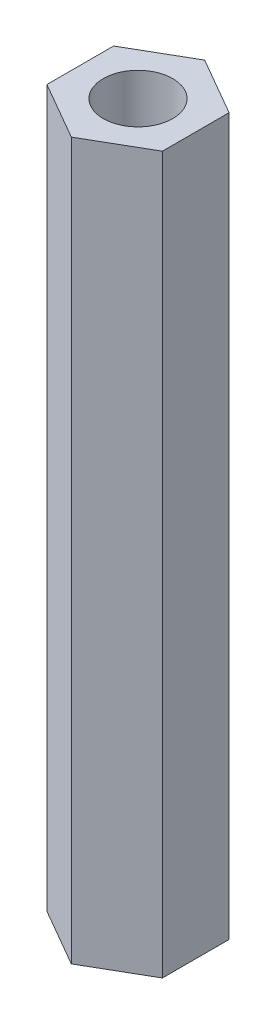
ISO-10303-21;
HEADER;
FILE_DESCRIPTION(('STEP AP214'),'2;1');
FILE_NAME('part.step','',(''),(''),'','','');
FILE_SCHEMA(('AUTOMOTIVE_DESIGN { 1 0 10303 214 1 1 1 1 }'));
ENDSEC;
DATA;
#1=APPLICATION_CONTEXT('core data for automotive mechanical design processes');
#2=APPLICATION_PROTOCOL_DEFINITION('international standard','automotive_design',2000,#1);
#3=PRODUCT_CONTEXT('',#1,'mechanical');
#4=PRODUCT('Part','Part','',(#3));
#5=PRODUCT_RELATED_PRODUCT_CATEGORY('part','',(#4));
#6=PRODUCT_DEFINITION_FORMATION('','',#4);
#7=PRODUCT_DEFINITION_CONTEXT('part definition',#1,'design');
#8=PRODUCT_DEFINITION('design','',#6,#7);
#9=PRODUCT_DEFINITION_SHAPE('','',#8);
#10=(LENGTH_UNIT() NAMED_UNIT(*) SI_UNIT(.MILLI.,.METRE.));
#11=(NAMED_UNIT(*) PLANE_ANGLE_UNIT() SI_UNIT($,.RADIAN.));
#12=(NAMED_UNIT(*) SI_UNIT($,.STERADIAN.) SOLID_ANGLE_UNIT());
#13=UNCERTAINTY_MEASURE_WITH_UNIT(LENGTH_MEASURE(1.E-05),#10,'distance_accuracy_value','');
#14=(GEOMETRIC_REPRESENTATION_CONTEXT(3) GLOBAL_UNCERTAINTY_ASSIGNED_CONTEXT((#13)) GLOBAL_UNIT_ASSIGNED_CONTEXT((#10,
#11,#12)) REPRESENTATION_CONTEXT('',''));
#15=CARTESIAN_POINT('',(0.,0.,0.));
#16=DIRECTION('',(0.,0.,1.));
#17=DIRECTION('',(1.,0.,0.));
#18=AXIS2_PLACEMENT_3D('',#15,#16,#17);
#19=CARTESIAN_POINT('',(2.5,31.,1.44337567297406));
#20=DIRECTION('',(-1.,0.,0.));
#21=DIRECTION('',(0.,0.,1.));
#22=AXIS2_PLACEMENT_3D('',#19,#20,#21);
#23=PLANE('',#22);
#24=DIRECTION('',(0.,0.,-1.));
#25=VECTOR('',#24,1.);
#26=CARTESIAN_POINT('',(2.5,0.,1.44337567297406));
#27=LINE('',#26,#25);
#28=CARTESIAN_POINT('',(2.5,0.,1.44337567297406));
#29=VERTEX_POINT('',#28);
#30=CARTESIAN_POINT('',(2.5,0.,-1.44337567297406));
#31=VERTEX_POINT('',#30);
#32=EDGE_CURVE('E118',#29,#31,#27,.T.);
#33=ORIENTED_EDGE('',*,*,#32,.T.);
#34=DIRECTION('',(0.,-1.,0.));
#35=VECTOR('',#34,1.);
#36=CARTESIAN_POINT('',(2.5,31.,-1.44337567297406));
#37=LINE('',#36,#35);
#38=CARTESIAN_POINT('',(2.5,31.,-1.44337567297406));
#39=VERTEX_POINT('',#38);
#40=EDGE_CURVE('E11',#39,#31,#37,.T.);
#41=ORIENTED_EDGE('',*,*,#40,.F.);
#42=DIRECTION('',(0.,0.,-1.));
#43=VECTOR('',#42,1.);
#44=CARTESIAN_POINT('',(2.5,31.,1.44337567297406));
#45=LINE('',#44,#43);
#46=CARTESIAN_POINT('',(2.5,31.,1.44337567297406));
#47=VERTEX_POINT('',#46);
#48=EDGE_CURVE('E129',#47,#39,#45,.T.);
#49=ORIENTED_EDGE('',*,*,#48,.F.);
#50=DIRECTION('',(0.,-1.,0.));
#51=VECTOR('',#50,1.);
#52=CARTESIAN_POINT('',(2.5,31.,1.44337567297406));
#53=LINE('',#52,#51);
#54=EDGE_CURVE('E114',#47,#29,#53,.T.);
#55=ORIENTED_EDGE('',*,*,#54,.T.);
#56=EDGE_LOOP('',(#33,#41,#49,#55));
#57=FACE_BOUND('',#56,.T.);
#58=ADVANCED_FACE('F34',(#57),#23,.F.);
#59=CARTESIAN_POINT('',(2.5,31.,-1.44337567297406));
#60=DIRECTION('',(-0.5,0.,0.866025403784439));
#61=DIRECTION('',(0.866025403784439,0.,0.5));
#62=AXIS2_PLACEMENT_3D('',#59,#60,#61);
#63=PLANE('',#62);
#64=DIRECTION('',(-0.866025403784439,0.,-0.5));
#65=VECTOR('',#64,1.);
#66=CARTESIAN_POINT('',(2.5,0.,-1.44337567297406));
#67=LINE('',#66,#65);
#68=CARTESIAN_POINT('',(0.,0.,-2.88675134594813));
#69=VERTEX_POINT('',#68);
#70=EDGE_CURVE('E121',#31,#69,#67,.T.);
#71=ORIENTED_EDGE('',*,*,#70,.T.);
#72=DIRECTION('',(0.,-1.,0.));
#73=VECTOR('',#72,1.);
#74=CARTESIAN_POINT('',(0.,31.,-2.88675134594813));
#75=LINE('',#74,#73);
#76=CARTESIAN_POINT('',(0.,31.,-2.88675134594813));
#77=VERTEX_POINT('',#76);
#78=EDGE_CURVE('E42',#77,#69,#75,.T.);
#79=ORIENTED_EDGE('',*,*,#78,.F.);
#80=DIRECTION('',(-0.866025403784439,0.,-0.5));
#81=VECTOR('',#80,1.);
#82=CARTESIAN_POINT('',(2.5,31.,-1.44337567297406));
#83=LINE('',#82,#81);
#84=EDGE_CURVE('E87',#39,#77,#83,.T.);
#85=ORIENTED_EDGE('',*,*,#84,.F.);
#86=ORIENTED_EDGE('',*,*,#40,.T.);
#87=EDGE_LOOP('',(#71,#79,#85,#86));
#88=FACE_BOUND('',#87,.T.);
#89=ADVANCED_FACE('F154',(#88),#63,.F.);
#90=CARTESIAN_POINT('',(0.,31.,-2.88675134594813));
#91=DIRECTION('',(0.5,0.,0.866025403784439));
#92=DIRECTION('',(0.866025403784439,0.,-0.5));
#93=AXIS2_PLACEMENT_3D('',#90,#91,#92);
#94=PLANE('',#93);
#95=DIRECTION('',(-0.866025403784438,0.,0.5));
#96=VECTOR('',#95,1.);
#97=CARTESIAN_POINT('',(0.,0.,-2.88675134594813));
#98=LINE('',#97,#96);
#99=CARTESIAN_POINT('',(-2.5,0.,-1.44337567297406));
#100=VERTEX_POINT('',#99);
#101=EDGE_CURVE('E124',#69,#100,#98,.T.);
#102=ORIENTED_EDGE('',*,*,#101,.T.);
#103=DIRECTION('',(0.,-1.,0.));
#104=VECTOR('',#103,1.);
#105=CARTESIAN_POINT('',(-2.5,31.,-1.44337567297406));
#106=LINE('',#105,#104);
#107=CARTESIAN_POINT('',(-2.5,31.,-1.44337567297406));
#108=VERTEX_POINT('',#107);
#109=EDGE_CURVE('E109',#108,#100,#106,.T.);
#110=ORIENTED_EDGE('',*,*,#109,.F.);
#111=DIRECTION('',(-0.866025403784438,0.,0.5));
#112=VECTOR('',#111,1.);
#113=CARTESIAN_POINT('',(0.,31.,-2.88675134594813));
#114=LINE('',#113,#112);
#115=EDGE_CURVE('E100',#77,#108,#114,.T.);
#116=ORIENTED_EDGE('',*,*,#115,.F.);
#117=ORIENTED_EDGE('',*,*,#78,.T.);
#118=EDGE_LOOP('',(#102,#110,#116,#117));
#119=FACE_BOUND('',#118,.T.);
#120=ADVANCED_FACE('F135',(#119),#94,.F.);
#121=CARTESIAN_POINT('',(-2.5,31.,-1.44337567297406));
#122=DIRECTION('',(1.,0.,0.));
#123=DIRECTION('',(0.,0.,-1.));
#124=AXIS2_PLACEMENT_3D('',#121,#122,#123);
#125=PLANE('',#124);
#126=DIRECTION('',(0.,0.,1.));
#127=VECTOR('',#126,1.);
#128=CARTESIAN_POINT('',(-2.5,0.,-1.44337567297406));
#129=LINE('',#128,#127);
#130=CARTESIAN_POINT('',(-2.5,0.,1.44337567297406));
#131=VERTEX_POINT('',#130);
#132=EDGE_CURVE('E108',#100,#131,#129,.T.);
#133=ORIENTED_EDGE('',*,*,#132,.T.);
#134=DIRECTION('',(0.,-1.,0.));
#135=VECTOR('',#134,1.);
#136=CARTESIAN_POINT('',(-2.5,31.,1.44337567297406));
#137=LINE('',#136,#135);
#138=CARTESIAN_POINT('',(-2.5,31.,1.44337567297406));
#139=VERTEX_POINT('',#138);
#140=EDGE_CURVE('E105',#139,#131,#137,.T.);
#141=ORIENTED_EDGE('',*,*,#140,.F.);
#142=DIRECTION('',(0.,0.,1.));
#143=VECTOR('',#142,1.);
#144=CARTESIAN_POINT('',(-2.5,31.,-1.44337567297406));
#145=LINE('',#144,#143);
#146=EDGE_CURVE('E94',#108,#139,#145,.T.);
#147=ORIENTED_EDGE('',*,*,#146,.F.);
#148=ORIENTED_EDGE('',*,*,#109,.T.);
#149=EDGE_LOOP('',(#133,#141,#147,#148));
#150=FACE_BOUND('',#149,.T.);
#151=ADVANCED_FACE('F106',(#150),#125,.F.);
#152=CARTESIAN_POINT('',(-2.5,31.,1.44337567297406));
#153=DIRECTION('',(0.5,0.,-0.866025403784439));
#154=DIRECTION('',(-0.866025403784439,0.,-0.5));
#155=AXIS2_PLACEMENT_3D('',#152,#153,#154);
#156=PLANE('',#155);
#157=DIRECTION('',(0.866025403784439,0.,0.5));
#158=VECTOR('',#157,1.);
#159=CARTESIAN_POINT('',(-2.5,0.,1.44337567297406));
#160=LINE('',#159,#158);
#161=CARTESIAN_POINT('',(0.,0.,2.88675134594813));
#162=VERTEX_POINT('',#161);
#163=EDGE_CURVE('E73',#131,#162,#160,.T.);
#164=ORIENTED_EDGE('',*,*,#163,.T.);
#165=DIRECTION('',(0.,-1.,0.));
#166=VECTOR('',#165,1.);
#167=CARTESIAN_POINT('',(0.,31.,2.88675134594813));
#168=LINE('',#167,#166);
#169=CARTESIAN_POINT('',(0.,31.,2.88675134594813));
#170=VERTEX_POINT('',#169);
#171=EDGE_CURVE('E110',#170,#162,#168,.T.);
#172=ORIENTED_EDGE('',*,*,#171,.F.);
#173=DIRECTION('',(0.866025403784439,0.,0.5));
#174=VECTOR('',#173,1.);
#175=CARTESIAN_POINT('',(-2.5,31.,1.44337567297406));
#176=LINE('',#175,#174);
#177=EDGE_CURVE('E98',#139,#170,#176,.T.);
#178=ORIENTED_EDGE('',*,*,#177,.F.);
#179=ORIENTED_EDGE('',*,*,#140,.T.);
#180=EDGE_LOOP('',(#164,#172,#178,#179));
#181=FACE_BOUND('',#180,.T.);
#182=ADVANCED_FACE('F112',(#181),#156,.F.);
#183=CARTESIAN_POINT('',(0.,31.,2.88675134594813));
#184=DIRECTION('',(-0.5,0.,-0.866025403784439));
#185=DIRECTION('',(-0.866025403784439,0.,0.5));
#186=AXIS2_PLACEMENT_3D('',#183,#184,#185);
#187=PLANE('',#186);
#188=DIRECTION('',(0.866025403784439,0.,-0.5));
#189=VECTOR('',#188,1.);
#190=CARTESIAN_POINT('',(0.,0.,2.88675134594813));
#191=LINE('',#190,#189);
#192=EDGE_CURVE('E79',#162,#29,#191,.T.);
#193=ORIENTED_EDGE('',*,*,#192,.T.);
#194=ORIENTED_EDGE('',*,*,#54,.F.);
#195=DIRECTION('',(0.866025403784439,0.,-0.5));
#196=VECTOR('',#195,1.);
#197=CARTESIAN_POINT('',(0.,31.,2.88675134594813));
#198=LINE('',#197,#196);
#199=EDGE_CURVE('E50',#170,#47,#198,.T.);
#200=ORIENTED_EDGE('',*,*,#199,.F.);
#201=ORIENTED_EDGE('',*,*,#171,.T.);
#202=EDGE_LOOP('',(#193,#194,#200,#201));
#203=FACE_BOUND('',#202,.T.);
#204=ADVANCED_FACE('F142',(#203),#187,.F.);
#205=CARTESIAN_POINT('',(0.,31.,0.));
#206=DIRECTION('',(0.,1.,0.));
#207=DIRECTION('',(0.,0.,1.));
#208=AXIS2_PLACEMENT_3D('',#205,#206,#207);
#209=PLANE('',#208);
#210=CARTESIAN_POINT('',(0.,31.,0.));
#211=DIRECTION('',(0.,1.,0.));
#212=DIRECTION('',(0.,0.,1.));
#213=AXIS2_PLACEMENT_3D('',#210,#211,#212);
#214=CIRCLE('',#213,1.5025);
#215=CARTESIAN_POINT('',(0.,31.,1.5025));
#216=VERTEX_POINT('',#215);
#217=EDGE_CURVE('E238',#216,#216,#214,.T.);
#218=ORIENTED_EDGE('',*,*,#217,.F.);
#219=EDGE_LOOP('',(#218));
#220=FACE_BOUND('',#219,.T.);
#221=ORIENTED_EDGE('',*,*,#48,.T.);
#222=ORIENTED_EDGE('',*,*,#84,.T.);
#223=ORIENTED_EDGE('',*,*,#115,.T.);
#224=ORIENTED_EDGE('',*,*,#146,.T.);
#225=ORIENTED_EDGE('',*,*,#177,.T.);
#226=ORIENTED_EDGE('',*,*,#199,.T.);
#227=EDGE_LOOP('',(#221,#222,#223,#224,#225,#226));
#228=FACE_BOUND('',#227,.T.);
#229=ADVANCED_FACE('F96',(#220,#228),#209,.T.);
#230=CARTESIAN_POINT('',(0.,0.,0.));
#231=DIRECTION('',(0.,1.,0.));
#232=DIRECTION('',(0.,0.,1.));
#233=AXIS2_PLACEMENT_3D('',#230,#231,#232);
#234=PLANE('',#233);
#235=CARTESIAN_POINT('',(0.,0.,0.));
#236=DIRECTION('',(0.,1.,0.));
#237=DIRECTION('',(0.,0.,1.));
#238=AXIS2_PLACEMENT_3D('',#235,#236,#237);
#239=CIRCLE('',#238,1.5025);
#240=CARTESIAN_POINT('',(0.,0.,1.5025));
#241=VERTEX_POINT('',#240);
#242=EDGE_CURVE('E237',#241,#241,#239,.T.);
#243=ORIENTED_EDGE('',*,*,#242,.T.);
#244=EDGE_LOOP('',(#243));
#245=FACE_BOUND('',#244,.T.);
#246=ORIENTED_EDGE('',*,*,#32,.F.);
#247=ORIENTED_EDGE('',*,*,#192,.F.);
#248=ORIENTED_EDGE('',*,*,#163,.F.);
#249=ORIENTED_EDGE('',*,*,#132,.F.);
#250=ORIENTED_EDGE('',*,*,#101,.F.);
#251=ORIENTED_EDGE('',*,*,#70,.F.);
#252=EDGE_LOOP('',(#246,#247,#248,#249,#250,#251));
#253=FACE_BOUND('',#252,.T.);
#254=ADVANCED_FACE('F138',(#245,#253),#234,.F.);
#255=CARTESIAN_POINT('',(0.,6.005,0.));
#256=DIRECTION('',(0.,-1.,0.));
#257=DIRECTION('',(0.,0.,-1.));
#258=AXIS2_PLACEMENT_3D('',#255,#256,#257);
#259=CYLINDRICAL_SURFACE('',#258,1.5025);
#260=CARTESIAN_POINT('',(0.,6.005,0.));
#261=DIRECTION('',(0.,1.,0.));
#262=DIRECTION('',(0.,0.,1.));
#263=AXIS2_PLACEMENT_3D('',#260,#261,#262);
#264=CIRCLE('',#263,1.5025);
#265=CARTESIAN_POINT('',(0.,6.005,1.5025));
#266=VERTEX_POINT('',#265);
#267=EDGE_CURVE('E122',#266,#266,#264,.T.);
#268=ORIENTED_EDGE('',*,*,#267,.T.);
#269=EDGE_LOOP('',(#268));
#270=FACE_BOUND('',#269,.T.);
#271=ORIENTED_EDGE('',*,*,#242,.F.);
#272=EDGE_LOOP('',(#271));
#273=FACE_BOUND('',#272,.T.);
#274=ADVANCED_FACE('F186',(#270,#273),#259,.F.);
#275=CARTESIAN_POINT('',(0.,6.005,0.));
#276=DIRECTION('',(0.,1.,0.));
#277=DIRECTION('',(0.,0.,1.));
#278=AXIS2_PLACEMENT_3D('',#275,#276,#277);
#279=PLANE('',#278);
#280=ORIENTED_EDGE('',*,*,#267,.F.);
#281=EDGE_LOOP('',(#280));
#282=FACE_BOUND('',#281,.T.);
#283=ADVANCED_FACE('F195',(#282),#279,.F.);
#284=CARTESIAN_POINT('',(0.,27.995,0.));
#285=DIRECTION('',(0.,1.,0.));
#286=DIRECTION('',(0.,0.,1.));
#287=AXIS2_PLACEMENT_3D('',#284,#285,#286);
#288=CYLINDRICAL_SURFACE('',#287,1.5025);
#289=CARTESIAN_POINT('',(0.,27.995,0.));
#290=DIRECTION('',(0.,1.,0.));
#291=DIRECTION('',(0.,0.,1.));
#292=AXIS2_PLACEMENT_3D('',#289,#290,#291);
#293=CIRCLE('',#292,1.5025);
#294=CARTESIAN_POINT('',(0.,27.995,1.5025));
#295=VERTEX_POINT('',#294);
#296=EDGE_CURVE('E236',#295,#295,#293,.T.);
#297=ORIENTED_EDGE('',*,*,#296,.F.);
#298=EDGE_LOOP('',(#297));
#299=FACE_BOUND('',#298,.T.);
#300=ORIENTED_EDGE('',*,*,#217,.T.);
#301=EDGE_LOOP('',(#300));
#302=FACE_BOUND('',#301,.T.);
#303=ADVANCED_FACE('F205',(#299,#302),#288,.F.);
#304=CARTESIAN_POINT('',(0.,27.995,0.));
#305=DIRECTION('',(0.,1.,0.));
#306=DIRECTION('',(0.,0.,1.));
#307=AXIS2_PLACEMENT_3D('',#304,#305,#306);
#308=PLANE('',#307);
#309=ORIENTED_EDGE('',*,*,#296,.T.);
#310=EDGE_LOOP('',(#309));
#311=FACE_BOUND('',#310,.T.);
#312=ADVANCED_FACE('F220',(#311),#308,.T.);
#313=CLOSED_SHELL('',(#58,#89,#120,#151,#182,#204,#229,#254,#274,#283,#303,#312));
#314=MANIFOLD_SOLID_BREP('B2',#313);
#315=ADVANCED_BREP_SHAPE_REPRESENTATION('',(#18,#314),#14);
#316=SHAPE_DEFINITION_REPRESENTATION(#9,#315);
ENDSEC;
END-ISO-10303-21;
